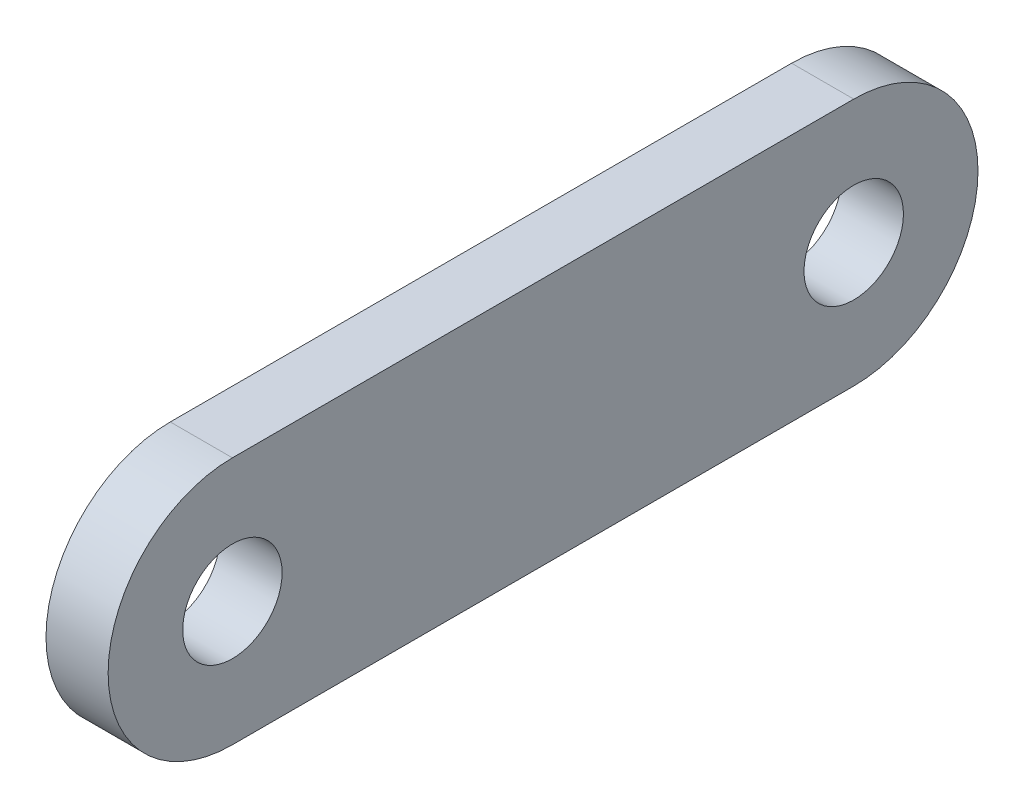
ISO-10303-21;
HEADER;
FILE_DESCRIPTION(('STEP AP214'),'2;1');
FILE_NAME('part.step','',(''),(''),'','','');
FILE_SCHEMA(('AUTOMOTIVE_DESIGN { 1 0 10303 214 1 1 1 1 }'));
ENDSEC;
DATA;
#1=APPLICATION_CONTEXT('core data for automotive mechanical design processes');
#2=APPLICATION_PROTOCOL_DEFINITION('international standard','automotive_design',2000,#1);
#3=PRODUCT_CONTEXT('',#1,'mechanical');
#4=PRODUCT('Part','Part','',(#3));
#5=PRODUCT_RELATED_PRODUCT_CATEGORY('part','',(#4));
#6=PRODUCT_DEFINITION_FORMATION('','',#4);
#7=PRODUCT_DEFINITION_CONTEXT('part definition',#1,'design');
#8=PRODUCT_DEFINITION('design','',#6,#7);
#9=PRODUCT_DEFINITION_SHAPE('','',#8);
#10=(LENGTH_UNIT() NAMED_UNIT(*) SI_UNIT(.MILLI.,.METRE.));
#11=(NAMED_UNIT(*) PLANE_ANGLE_UNIT() SI_UNIT($,.RADIAN.));
#12=(NAMED_UNIT(*) SI_UNIT($,.STERADIAN.) SOLID_ANGLE_UNIT());
#13=UNCERTAINTY_MEASURE_WITH_UNIT(LENGTH_MEASURE(1.E-05),#10,'distance_accuracy_value','');
#14=(GEOMETRIC_REPRESENTATION_CONTEXT(3) GLOBAL_UNCERTAINTY_ASSIGNED_CONTEXT((#13)) GLOBAL_UNIT_ASSIGNED_CONTEXT((#10,
#11,#12)) REPRESENTATION_CONTEXT('',''));
#15=CARTESIAN_POINT('',(0.,0.,0.));
#16=DIRECTION('',(0.,0.,1.));
#17=DIRECTION('',(1.,0.,0.));
#18=AXIS2_PLACEMENT_3D('',#15,#16,#17);
#19=CARTESIAN_POINT('',(5.,0.,25.));
#20=DIRECTION('',(-1.,0.,0.));
#21=DIRECTION('',(0.,0.,1.));
#22=AXIS2_PLACEMENT_3D('',#19,#20,#21);
#23=CYLINDRICAL_SURFACE('',#22,10.);
#24=CARTESIAN_POINT('',(0.,0.,25.));
#25=DIRECTION('',(1.,0.,0.));
#26=DIRECTION('',(0.,0.,-1.));
#27=AXIS2_PLACEMENT_3D('',#24,#25,#26);
#28=CIRCLE('',#27,10.);
#29=CARTESIAN_POINT('',(0.,10.,25.));
#30=VERTEX_POINT('',#29);
#31=CARTESIAN_POINT('',(0.,-10.,25.));
#32=VERTEX_POINT('',#31);
#33=EDGE_CURVE('E106',#30,#32,#28,.T.);
#34=ORIENTED_EDGE('',*,*,#33,.T.);
#35=DIRECTION('',(-1.,0.,0.));
#36=VECTOR('',#35,1.);
#37=CARTESIAN_POINT('',(5.,-10.,25.));
#38=LINE('',#37,#36);
#39=CARTESIAN_POINT('',(5.,-10.,25.));
#40=VERTEX_POINT('',#39);
#41=EDGE_CURVE('E13',#40,#32,#38,.T.);
#42=ORIENTED_EDGE('',*,*,#41,.F.);
#43=CARTESIAN_POINT('',(5.,0.,25.));
#44=DIRECTION('',(1.,0.,0.));
#45=DIRECTION('',(0.,0.,-1.));
#46=AXIS2_PLACEMENT_3D('',#43,#44,#45);
#47=CIRCLE('',#46,10.);
#48=CARTESIAN_POINT('',(5.,10.,25.));
#49=VERTEX_POINT('',#48);
#50=EDGE_CURVE('E94',#49,#40,#47,.T.);
#51=ORIENTED_EDGE('',*,*,#50,.F.);
#52=DIRECTION('',(-1.,0.,0.));
#53=VECTOR('',#52,1.);
#54=CARTESIAN_POINT('',(5.,10.,25.));
#55=LINE('',#54,#53);
#56=EDGE_CURVE('E102',#49,#30,#55,.T.);
#57=ORIENTED_EDGE('',*,*,#56,.T.);
#58=EDGE_LOOP('',(#34,#42,#51,#57));
#59=FACE_BOUND('',#58,.T.);
#60=ADVANCED_FACE('F43',(#59),#23,.T.);
#61=CARTESIAN_POINT('',(5.,-10.,25.));
#62=DIRECTION('',(0.,1.,0.));
#63=DIRECTION('',(0.,0.,1.));
#64=AXIS2_PLACEMENT_3D('',#61,#62,#63);
#65=PLANE('',#64);
#66=DIRECTION('',(0.,0.,-1.));
#67=VECTOR('',#66,1.);
#68=CARTESIAN_POINT('',(0.,-10.,25.));
#69=LINE('',#68,#67);
#70=CARTESIAN_POINT('',(0.,-9.99999999999999,-25.));
#71=VERTEX_POINT('',#70);
#72=EDGE_CURVE('E98',#32,#71,#69,.T.);
#73=ORIENTED_EDGE('',*,*,#72,.T.);
#74=DIRECTION('',(-1.,0.,0.));
#75=VECTOR('',#74,1.);
#76=CARTESIAN_POINT('',(5.,-9.99999999999999,-25.));
#77=LINE('',#76,#75);
#78=CARTESIAN_POINT('',(5.,-9.99999999999999,-25.));
#79=VERTEX_POINT('',#78);
#80=EDGE_CURVE('E51',#79,#71,#77,.T.);
#81=ORIENTED_EDGE('',*,*,#80,.F.);
#82=DIRECTION('',(0.,0.,-1.));
#83=VECTOR('',#82,1.);
#84=CARTESIAN_POINT('',(5.,-10.,25.));
#85=LINE('',#84,#83);
#86=EDGE_CURVE('E89',#40,#79,#85,.T.);
#87=ORIENTED_EDGE('',*,*,#86,.F.);
#88=ORIENTED_EDGE('',*,*,#41,.T.);
#89=EDGE_LOOP('',(#73,#81,#87,#88));
#90=FACE_BOUND('',#89,.T.);
#91=ADVANCED_FACE('F97',(#90),#65,.F.);
#92=CARTESIAN_POINT('',(5.,0.,-25.));
#93=DIRECTION('',(-1.,0.,0.));
#94=DIRECTION('',(0.,0.,1.));
#95=AXIS2_PLACEMENT_3D('',#92,#93,#94);
#96=CYLINDRICAL_SURFACE('',#95,10.);
#97=CARTESIAN_POINT('',(0.,0.,-25.));
#98=DIRECTION('',(1.,0.,0.));
#99=DIRECTION('',(0.,0.,-1.));
#100=AXIS2_PLACEMENT_3D('',#97,#98,#99);
#101=CIRCLE('',#100,10.);
#102=CARTESIAN_POINT('',(0.,10.,-25.));
#103=VERTEX_POINT('',#102);
#104=EDGE_CURVE('E76',#71,#103,#101,.T.);
#105=ORIENTED_EDGE('',*,*,#104,.T.);
#106=DIRECTION('',(-1.,0.,0.));
#107=VECTOR('',#106,1.);
#108=CARTESIAN_POINT('',(5.,10.,-25.));
#109=LINE('',#108,#107);
#110=CARTESIAN_POINT('',(5.,10.,-25.));
#111=VERTEX_POINT('',#110);
#112=EDGE_CURVE('E99',#111,#103,#109,.T.);
#113=ORIENTED_EDGE('',*,*,#112,.F.);
#114=CARTESIAN_POINT('',(5.,0.,-25.));
#115=DIRECTION('',(1.,0.,0.));
#116=DIRECTION('',(0.,0.,-1.));
#117=AXIS2_PLACEMENT_3D('',#114,#115,#116);
#118=CIRCLE('',#117,10.);
#119=EDGE_CURVE('E92',#79,#111,#118,.T.);
#120=ORIENTED_EDGE('',*,*,#119,.F.);
#121=ORIENTED_EDGE('',*,*,#80,.T.);
#122=EDGE_LOOP('',(#105,#113,#120,#121));
#123=FACE_BOUND('',#122,.T.);
#124=ADVANCED_FACE('F100',(#123),#96,.T.);
#125=CARTESIAN_POINT('',(5.,10.,25.));
#126=DIRECTION('',(0.,-1.,0.));
#127=DIRECTION('',(0.,0.,-1.));
#128=AXIS2_PLACEMENT_3D('',#125,#126,#127);
#129=PLANE('',#128);
#130=DIRECTION('',(0.,0.,1.));
#131=VECTOR('',#130,1.);
#132=CARTESIAN_POINT('',(0.,10.,25.));
#133=LINE('',#132,#131);
#134=EDGE_CURVE('E82',#103,#30,#133,.T.);
#135=ORIENTED_EDGE('',*,*,#134,.T.);
#136=ORIENTED_EDGE('',*,*,#56,.F.);
#137=DIRECTION('',(0.,0.,1.));
#138=VECTOR('',#137,1.);
#139=CARTESIAN_POINT('',(5.,10.,25.));
#140=LINE('',#139,#138);
#141=EDGE_CURVE('E59',#111,#49,#140,.T.);
#142=ORIENTED_EDGE('',*,*,#141,.F.);
#143=ORIENTED_EDGE('',*,*,#112,.T.);
#144=EDGE_LOOP('',(#135,#136,#142,#143));
#145=FACE_BOUND('',#144,.T.);
#146=ADVANCED_FACE('F114',(#145),#129,.F.);
#147=CARTESIAN_POINT('',(5.,0.,25.));
#148=DIRECTION('',(1.,0.,0.));
#149=DIRECTION('',(0.,0.,-1.));
#150=AXIS2_PLACEMENT_3D('',#147,#148,#149);
#151=PLANE('',#150);
#152=CARTESIAN_POINT('',(5.,0.,-25.));
#153=DIRECTION('',(1.,0.,0.));
#154=DIRECTION('',(0.,0.,-1.));
#155=AXIS2_PLACEMENT_3D('',#152,#153,#154);
#156=CIRCLE('',#155,4.);
#157=CARTESIAN_POINT('',(5.,0.,-29.));
#158=VERTEX_POINT('',#157);
#159=EDGE_CURVE('E126',#158,#158,#156,.T.);
#160=ORIENTED_EDGE('',*,*,#159,.F.);
#161=EDGE_LOOP('',(#160));
#162=FACE_BOUND('',#161,.T.);
#163=CARTESIAN_POINT('',(5.,0.,25.));
#164=DIRECTION('',(1.,0.,0.));
#165=DIRECTION('',(0.,0.,-1.));
#166=AXIS2_PLACEMENT_3D('',#163,#164,#165);
#167=CIRCLE('',#166,4.);
#168=CARTESIAN_POINT('',(5.,0.,21.));
#169=VERTEX_POINT('',#168);
#170=EDGE_CURVE('E120',#169,#169,#167,.T.);
#171=ORIENTED_EDGE('',*,*,#170,.F.);
#172=EDGE_LOOP('',(#171));
#173=FACE_BOUND('',#172,.T.);
#174=ORIENTED_EDGE('',*,*,#50,.T.);
#175=ORIENTED_EDGE('',*,*,#86,.T.);
#176=ORIENTED_EDGE('',*,*,#119,.T.);
#177=ORIENTED_EDGE('',*,*,#141,.T.);
#178=EDGE_LOOP('',(#174,#175,#176,#177));
#179=FACE_BOUND('',#178,.T.);
#180=ADVANCED_FACE('F90',(#162,#173,#179),#151,.T.);
#181=CARTESIAN_POINT('',(0.,0.,25.));
#182=DIRECTION('',(1.,0.,0.));
#183=DIRECTION('',(0.,0.,-1.));
#184=AXIS2_PLACEMENT_3D('',#181,#182,#183);
#185=PLANE('',#184);
#186=CARTESIAN_POINT('',(0.,0.,-25.));
#187=DIRECTION('',(1.,0.,0.));
#188=DIRECTION('',(0.,0.,-1.));
#189=AXIS2_PLACEMENT_3D('',#186,#187,#188);
#190=CIRCLE('',#189,4.);
#191=CARTESIAN_POINT('',(0.,0.,-29.));
#192=VERTEX_POINT('',#191);
#193=EDGE_CURVE('E123',#192,#192,#190,.T.);
#194=ORIENTED_EDGE('',*,*,#193,.T.);
#195=EDGE_LOOP('',(#194));
#196=FACE_BOUND('',#195,.T.);
#197=CARTESIAN_POINT('',(0.,0.,25.));
#198=DIRECTION('',(1.,0.,0.));
#199=DIRECTION('',(0.,0.,-1.));
#200=AXIS2_PLACEMENT_3D('',#197,#198,#199);
#201=CIRCLE('',#200,4.);
#202=CARTESIAN_POINT('',(0.,0.,21.));
#203=VERTEX_POINT('',#202);
#204=EDGE_CURVE('E109',#203,#203,#201,.T.);
#205=ORIENTED_EDGE('',*,*,#204,.T.);
#206=EDGE_LOOP('',(#205));
#207=FACE_BOUND('',#206,.T.);
#208=ORIENTED_EDGE('',*,*,#33,.F.);
#209=ORIENTED_EDGE('',*,*,#134,.F.);
#210=ORIENTED_EDGE('',*,*,#104,.F.);
#211=ORIENTED_EDGE('',*,*,#72,.F.);
#212=EDGE_LOOP('',(#208,#209,#210,#211));
#213=FACE_BOUND('',#212,.T.);
#214=ADVANCED_FACE('F117',(#196,#207,#213),#185,.F.);
#215=CARTESIAN_POINT('',(0.,0.,25.));
#216=DIRECTION('',(1.,0.,0.));
#217=DIRECTION('',(0.,0.,-1.));
#218=AXIS2_PLACEMENT_3D('',#215,#216,#217);
#219=CYLINDRICAL_SURFACE('',#218,4.);
#220=ORIENTED_EDGE('',*,*,#204,.F.);
#221=EDGE_LOOP('',(#220));
#222=FACE_BOUND('',#221,.T.);
#223=ORIENTED_EDGE('',*,*,#170,.T.);
#224=EDGE_LOOP('',(#223));
#225=FACE_BOUND('',#224,.T.);
#226=ADVANCED_FACE('F137',(#222,#225),#219,.F.);
#227=CARTESIAN_POINT('',(0.,0.,-25.));
#228=DIRECTION('',(1.,0.,0.));
#229=DIRECTION('',(0.,0.,-1.));
#230=AXIS2_PLACEMENT_3D('',#227,#228,#229);
#231=CYLINDRICAL_SURFACE('',#230,4.);
#232=ORIENTED_EDGE('',*,*,#193,.F.);
#233=EDGE_LOOP('',(#232));
#234=FACE_BOUND('',#233,.T.);
#235=ORIENTED_EDGE('',*,*,#159,.T.);
#236=EDGE_LOOP('',(#235));
#237=FACE_BOUND('',#236,.T.);
#238=ADVANCED_FACE('F134',(#234,#237),#231,.F.);
#239=CLOSED_SHELL('',(#60,#91,#124,#146,#180,#214,#226,#238));
#240=MANIFOLD_SOLID_BREP('B2',#239);
#241=ADVANCED_BREP_SHAPE_REPRESENTATION('',(#18,#240),#14);
#242=SHAPE_DEFINITION_REPRESENTATION(#9,#241);
ENDSEC;
END-ISO-10303-21;
